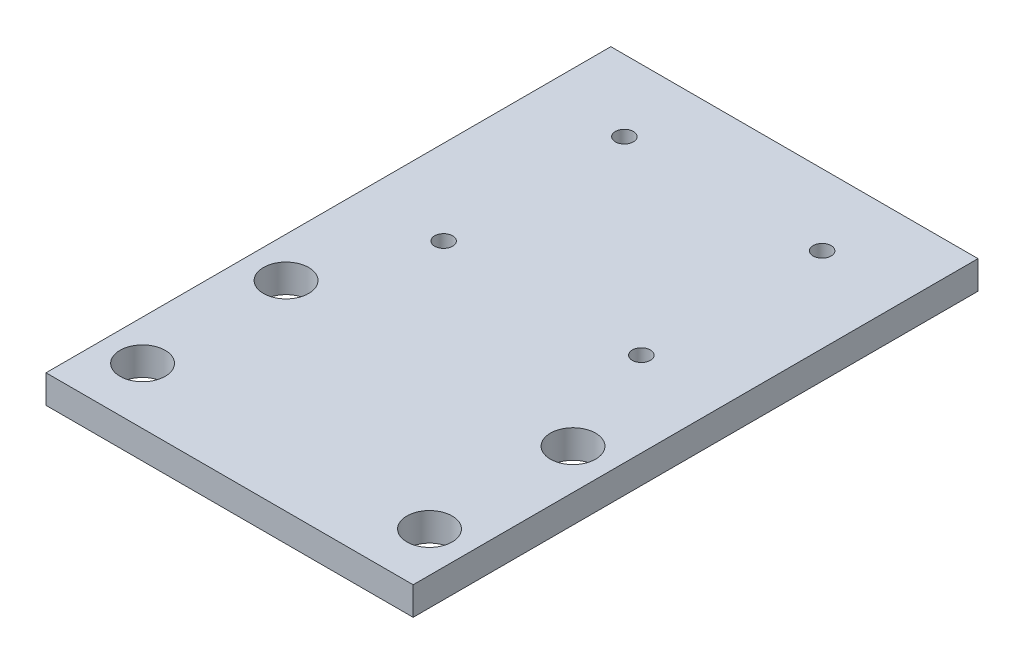
ISO-10303-21;
HEADER;
FILE_DESCRIPTION(('STEP AP214'),'2;1');
FILE_NAME('part.step','',(''),(''),'','','');
FILE_SCHEMA(('AUTOMOTIVE_DESIGN { 1 0 10303 214 1 1 1 1 }'));
ENDSEC;
DATA;
#1=APPLICATION_CONTEXT('core data for automotive mechanical design processes');
#2=APPLICATION_PROTOCOL_DEFINITION('international standard','automotive_design',2000,#1);
#3=PRODUCT_CONTEXT('',#1,'mechanical');
#4=PRODUCT('Part','Part','',(#3));
#5=PRODUCT_RELATED_PRODUCT_CATEGORY('part','',(#4));
#6=PRODUCT_DEFINITION_FORMATION('','',#4);
#7=PRODUCT_DEFINITION_CONTEXT('part definition',#1,'design');
#8=PRODUCT_DEFINITION('design','',#6,#7);
#9=PRODUCT_DEFINITION_SHAPE('','',#8);
#10=(LENGTH_UNIT() NAMED_UNIT(*) SI_UNIT(.MILLI.,.METRE.));
#11=(NAMED_UNIT(*) PLANE_ANGLE_UNIT() SI_UNIT($,.RADIAN.));
#12=(NAMED_UNIT(*) SI_UNIT($,.STERADIAN.) SOLID_ANGLE_UNIT());
#13=UNCERTAINTY_MEASURE_WITH_UNIT(LENGTH_MEASURE(1.E-05),#10,'distance_accuracy_value','');
#14=(GEOMETRIC_REPRESENTATION_CONTEXT(3) GLOBAL_UNCERTAINTY_ASSIGNED_CONTEXT((#13)) GLOBAL_UNIT_ASSIGNED_CONTEXT((#10,
#11,#12)) REPRESENTATION_CONTEXT('',''));
#15=CARTESIAN_POINT('',(0.,0.,0.));
#16=DIRECTION('',(0.,0.,1.));
#17=DIRECTION('',(1.,0.,0.));
#18=AXIS2_PLACEMENT_3D('',#15,#16,#17);
#19=CARTESIAN_POINT('',(17.5,5.,-37.4));
#20=DIRECTION('',(0.,-1.,0.));
#21=DIRECTION('',(0.,0.,-1.));
#22=AXIS2_PLACEMENT_3D('',#19,#20,#21);
#23=CYLINDRICAL_SURFACE('',#22,1.6);
#24=CARTESIAN_POINT('',(17.5,5.,-37.4));
#25=DIRECTION('',(0.,1.,0.));
#26=DIRECTION('',(0.,0.,-1.));
#27=AXIS2_PLACEMENT_3D('',#24,#25,#26);
#28=CIRCLE('',#27,1.6);
#29=CARTESIAN_POINT('',(17.5,5.,-39.));
#30=VERTEX_POINT('',#29);
#31=EDGE_CURVE('E148',#30,#30,#28,.T.);
#32=ORIENTED_EDGE('',*,*,#31,.T.);
#33=EDGE_LOOP('',(#32));
#34=FACE_BOUND('',#33,.T.);
#35=CARTESIAN_POINT('',(17.5,2.,-37.4));
#36=DIRECTION('',(0.,-1.,0.));
#37=DIRECTION('',(0.,0.,-1.));
#38=AXIS2_PLACEMENT_3D('',#35,#36,#37);
#39=CIRCLE('',#38,1.6);
#40=CARTESIAN_POINT('',(17.5,2.,-39.));
#41=VERTEX_POINT('',#40);
#42=EDGE_CURVE('E39',#41,#41,#39,.T.);
#43=ORIENTED_EDGE('',*,*,#42,.T.);
#44=EDGE_LOOP('',(#43));
#45=FACE_BOUND('',#44,.T.);
#46=ADVANCED_FACE('F35',(#34,#45),#23,.F.);
#47=CARTESIAN_POINT('',(-17.5,5.,-37.4));
#48=DIRECTION('',(0.,-1.,0.));
#49=DIRECTION('',(0.,0.,-1.));
#50=AXIS2_PLACEMENT_3D('',#47,#48,#49);
#51=CYLINDRICAL_SURFACE('',#50,1.6);
#52=CARTESIAN_POINT('',(-17.5,5.,-37.4));
#53=DIRECTION('',(0.,1.,0.));
#54=DIRECTION('',(0.,0.,1.));
#55=AXIS2_PLACEMENT_3D('',#52,#53,#54);
#56=CIRCLE('',#55,1.6);
#57=CARTESIAN_POINT('',(-17.5,5.,-35.8));
#58=VERTEX_POINT('',#57);
#59=EDGE_CURVE('E151',#58,#58,#56,.T.);
#60=ORIENTED_EDGE('',*,*,#59,.T.);
#61=EDGE_LOOP('',(#60));
#62=FACE_BOUND('',#61,.T.);
#63=CARTESIAN_POINT('',(-17.5,2.,-37.4));
#64=DIRECTION('',(0.,-1.,0.));
#65=DIRECTION('',(0.,0.,-1.));
#66=AXIS2_PLACEMENT_3D('',#63,#64,#65);
#67=CIRCLE('',#66,1.6);
#68=CARTESIAN_POINT('',(-17.5,2.,-39.));
#69=VERTEX_POINT('',#68);
#70=EDGE_CURVE('E121',#69,#69,#67,.T.);
#71=ORIENTED_EDGE('',*,*,#70,.T.);
#72=EDGE_LOOP('',(#71));
#73=FACE_BOUND('',#72,.T.);
#74=ADVANCED_FACE('F200',(#62,#73),#51,.F.);
#75=CARTESIAN_POINT('',(17.5,5.,-5.39999999999998));
#76=DIRECTION('',(0.,-1.,0.));
#77=DIRECTION('',(0.,0.,-1.));
#78=AXIS2_PLACEMENT_3D('',#75,#76,#77);
#79=CYLINDRICAL_SURFACE('',#78,1.60000000000001);
#80=CARTESIAN_POINT('',(17.5,5.,-5.39999999999998));
#81=DIRECTION('',(0.,1.,0.));
#82=DIRECTION('',(0.,0.,-1.));
#83=AXIS2_PLACEMENT_3D('',#80,#81,#82);
#84=CIRCLE('',#83,1.60000000000001);
#85=CARTESIAN_POINT('',(17.5,5.,-6.99999999999998));
#86=VERTEX_POINT('',#85);
#87=EDGE_CURVE('E115',#86,#86,#84,.T.);
#88=ORIENTED_EDGE('',*,*,#87,.T.);
#89=EDGE_LOOP('',(#88));
#90=FACE_BOUND('',#89,.T.);
#91=CARTESIAN_POINT('',(17.5,2.,-5.39999999999998));
#92=DIRECTION('',(0.,-1.,0.));
#93=DIRECTION('',(0.,0.,-1.));
#94=AXIS2_PLACEMENT_3D('',#91,#92,#93);
#95=CIRCLE('',#94,1.60000000000001);
#96=CARTESIAN_POINT('',(17.5,2.,-6.99999999999998));
#97=VERTEX_POINT('',#96);
#98=EDGE_CURVE('E117',#97,#97,#95,.T.);
#99=ORIENTED_EDGE('',*,*,#98,.T.);
#100=EDGE_LOOP('',(#99));
#101=FACE_BOUND('',#100,.T.);
#102=ADVANCED_FACE('F206',(#90,#101),#79,.F.);
#103=CARTESIAN_POINT('',(-17.5,5.,-5.39999999999998));
#104=DIRECTION('',(0.,-1.,0.));
#105=DIRECTION('',(0.,0.,-1.));
#106=AXIS2_PLACEMENT_3D('',#103,#104,#105);
#107=CYLINDRICAL_SURFACE('',#106,1.6);
#108=CARTESIAN_POINT('',(-17.5,5.,-5.39999999999998));
#109=DIRECTION('',(0.,1.,0.));
#110=DIRECTION('',(0.,0.,1.));
#111=AXIS2_PLACEMENT_3D('',#108,#109,#110);
#112=CIRCLE('',#111,1.6);
#113=CARTESIAN_POINT('',(-17.5,5.,-3.79999999999998));
#114=VERTEX_POINT('',#113);
#115=EDGE_CURVE('E154',#114,#114,#112,.T.);
#116=ORIENTED_EDGE('',*,*,#115,.T.);
#117=EDGE_LOOP('',(#116));
#118=FACE_BOUND('',#117,.T.);
#119=CARTESIAN_POINT('',(-17.5,2.,-5.39999999999998));
#120=DIRECTION('',(0.,-1.,0.));
#121=DIRECTION('',(0.,0.,-1.));
#122=AXIS2_PLACEMENT_3D('',#119,#120,#121);
#123=CIRCLE('',#122,1.6);
#124=CARTESIAN_POINT('',(-17.5,2.,-6.99999999999998));
#125=VERTEX_POINT('',#124);
#126=EDGE_CURVE('E112',#125,#125,#123,.T.);
#127=ORIENTED_EDGE('',*,*,#126,.T.);
#128=EDGE_LOOP('',(#127));
#129=FACE_BOUND('',#128,.T.);
#130=ADVANCED_FACE('F213',(#118,#129),#107,.F.);
#131=CARTESIAN_POINT('',(0.,5.,0.));
#132=DIRECTION('',(0.,1.,0.));
#133=DIRECTION('',(0.,0.,1.));
#134=AXIS2_PLACEMENT_3D('',#131,#132,#133);
#135=PLANE('',#134);
#136=ORIENTED_EDGE('',*,*,#31,.F.);
#137=EDGE_LOOP('',(#136));
#138=FACE_BOUND('',#137,.T.);
#139=ORIENTED_EDGE('',*,*,#115,.F.);
#140=EDGE_LOOP('',(#139));
#141=FACE_BOUND('',#140,.T.);
#142=CARTESIAN_POINT('',(-25.4000000000001,5.,14.6));
#143=DIRECTION('',(0.,1.,0.));
#144=DIRECTION('',(0.,0.,1.));
#145=AXIS2_PLACEMENT_3D('',#142,#143,#144);
#146=CIRCLE('',#145,4.);
#147=CARTESIAN_POINT('',(-25.4000000000001,5.,18.6));
#148=VERTEX_POINT('',#147);
#149=EDGE_CURVE('E164',#148,#148,#146,.T.);
#150=ORIENTED_EDGE('',*,*,#149,.F.);
#151=EDGE_LOOP('',(#150));
#152=FACE_BOUND('',#151,.T.);
#153=CARTESIAN_POINT('',(-25.4,5.,40.));
#154=DIRECTION('',(0.,1.,0.));
#155=DIRECTION('',(0.,0.,1.));
#156=AXIS2_PLACEMENT_3D('',#153,#154,#155);
#157=CIRCLE('',#156,4.);
#158=CARTESIAN_POINT('',(-25.4,5.,44.));
#159=VERTEX_POINT('',#158);
#160=EDGE_CURVE('E106',#159,#159,#157,.T.);
#161=ORIENTED_EDGE('',*,*,#160,.F.);
#162=EDGE_LOOP('',(#161));
#163=FACE_BOUND('',#162,.T.);
#164=DIRECTION('',(0.,0.,-1.));
#165=VECTOR('',#164,1.);
#166=CARTESIAN_POINT('',(32.5,5.,-50.));
#167=LINE('',#166,#165);
#168=CARTESIAN_POINT('',(32.5,5.,50.));
#169=VERTEX_POINT('',#168);
#170=CARTESIAN_POINT('',(32.5,5.,-50.));
#171=VERTEX_POINT('',#170);
#172=EDGE_CURVE('E90',#169,#171,#167,.T.);
#173=ORIENTED_EDGE('',*,*,#172,.T.);
#174=DIRECTION('',(-1.,0.,0.));
#175=VECTOR('',#174,1.);
#176=CARTESIAN_POINT('',(-32.5,5.,-50.));
#177=LINE('',#176,#175);
#178=CARTESIAN_POINT('',(-32.5,5.,-50.));
#179=VERTEX_POINT('',#178);
#180=EDGE_CURVE('E84',#171,#179,#177,.T.);
#181=ORIENTED_EDGE('',*,*,#180,.T.);
#182=DIRECTION('',(0.,0.,1.));
#183=VECTOR('',#182,1.);
#184=CARTESIAN_POINT('',(-32.5,5.,-50.));
#185=LINE('',#184,#183);
#186=CARTESIAN_POINT('',(-32.5,5.,50.));
#187=VERTEX_POINT('',#186);
#188=EDGE_CURVE('E88',#179,#187,#185,.T.);
#189=ORIENTED_EDGE('',*,*,#188,.T.);
#190=DIRECTION('',(1.,0.,0.));
#191=VECTOR('',#190,1.);
#192=CARTESIAN_POINT('',(-32.5,5.,50.));
#193=LINE('',#192,#191);
#194=EDGE_CURVE('E54',#187,#169,#193,.T.);
#195=ORIENTED_EDGE('',*,*,#194,.T.);
#196=EDGE_LOOP('',(#173,#181,#189,#195));
#197=FACE_BOUND('',#196,.T.);
#198=CARTESIAN_POINT('',(25.4,5.,40.));
#199=DIRECTION('',(0.,1.,0.));
#200=DIRECTION('',(0.,0.,1.));
#201=AXIS2_PLACEMENT_3D('',#198,#199,#200);
#202=CIRCLE('',#201,4.);
#203=CARTESIAN_POINT('',(25.4,5.,44.));
#204=VERTEX_POINT('',#203);
#205=EDGE_CURVE('E170',#204,#204,#202,.T.);
#206=ORIENTED_EDGE('',*,*,#205,.F.);
#207=EDGE_LOOP('',(#206));
#208=FACE_BOUND('',#207,.T.);
#209=CARTESIAN_POINT('',(25.3999999999999,5.,14.6));
#210=DIRECTION('',(0.,1.,0.));
#211=DIRECTION('',(0.,0.,1.));
#212=AXIS2_PLACEMENT_3D('',#209,#210,#211);
#213=CIRCLE('',#212,4.);
#214=CARTESIAN_POINT('',(25.3999999999999,5.,18.6));
#215=VERTEX_POINT('',#214);
#216=EDGE_CURVE('E158',#215,#215,#213,.T.);
#217=ORIENTED_EDGE('',*,*,#216,.F.);
#218=EDGE_LOOP('',(#217));
#219=FACE_BOUND('',#218,.T.);
#220=ORIENTED_EDGE('',*,*,#59,.F.);
#221=EDGE_LOOP('',(#220));
#222=FACE_BOUND('',#221,.T.);
#223=ORIENTED_EDGE('',*,*,#87,.F.);
#224=EDGE_LOOP('',(#223));
#225=FACE_BOUND('',#224,.T.);
#226=ADVANCED_FACE('F85',(#138,#141,#152,#163,#197,#208,#219,#222,#225),#135,.T.);
#227=CARTESIAN_POINT('',(0.,0.,0.));
#228=DIRECTION('',(0.,1.,0.));
#229=DIRECTION('',(0.,0.,1.));
#230=AXIS2_PLACEMENT_3D('',#227,#228,#229);
#231=PLANE('',#230);
#232=CARTESIAN_POINT('',(17.5,0.,-37.4));
#233=DIRECTION('',(0.,-1.,0.));
#234=DIRECTION('',(0.,0.,-1.));
#235=AXIS2_PLACEMENT_3D('',#232,#233,#234);
#236=CIRCLE('',#235,3.5);
#237=CARTESIAN_POINT('',(17.5,0.,-40.9));
#238=VERTEX_POINT('',#237);
#239=EDGE_CURVE('E137',#238,#238,#236,.T.);
#240=ORIENTED_EDGE('',*,*,#239,.F.);
#241=EDGE_LOOP('',(#240));
#242=FACE_BOUND('',#241,.T.);
#243=CARTESIAN_POINT('',(-17.5,0.,-37.4));
#244=DIRECTION('',(0.,-1.,0.));
#245=DIRECTION('',(0.,0.,-1.));
#246=AXIS2_PLACEMENT_3D('',#243,#244,#245);
#247=CIRCLE('',#246,3.5);
#248=CARTESIAN_POINT('',(-17.5,0.,-40.9));
#249=VERTEX_POINT('',#248);
#250=EDGE_CURVE('E130',#249,#249,#247,.T.);
#251=ORIENTED_EDGE('',*,*,#250,.F.);
#252=EDGE_LOOP('',(#251));
#253=FACE_BOUND('',#252,.T.);
#254=CARTESIAN_POINT('',(17.5,0.,-5.39999999999998));
#255=DIRECTION('',(0.,-1.,0.));
#256=DIRECTION('',(0.,0.,-1.));
#257=AXIS2_PLACEMENT_3D('',#254,#255,#256);
#258=CIRCLE('',#257,3.5);
#259=CARTESIAN_POINT('',(17.5,0.,-8.89999999999998));
#260=VERTEX_POINT('',#259);
#261=EDGE_CURVE('E123',#260,#260,#258,.T.);
#262=ORIENTED_EDGE('',*,*,#261,.F.);
#263=EDGE_LOOP('',(#262));
#264=FACE_BOUND('',#263,.T.);
#265=CARTESIAN_POINT('',(-17.5,0.,-5.39999999999998));
#266=DIRECTION('',(0.,-1.,0.));
#267=DIRECTION('',(0.,0.,-1.));
#268=AXIS2_PLACEMENT_3D('',#265,#266,#267);
#269=CIRCLE('',#268,3.5);
#270=CARTESIAN_POINT('',(-17.5,0.,-8.89999999999998));
#271=VERTEX_POINT('',#270);
#272=EDGE_CURVE('E119',#271,#271,#269,.T.);
#273=ORIENTED_EDGE('',*,*,#272,.F.);
#274=EDGE_LOOP('',(#273));
#275=FACE_BOUND('',#274,.T.);
#276=DIRECTION('',(0.,0.,-1.));
#277=VECTOR('',#276,1.);
#278=CARTESIAN_POINT('',(32.5,0.,-50.));
#279=LINE('',#278,#277);
#280=CARTESIAN_POINT('',(32.5,0.,50.));
#281=VERTEX_POINT('',#280);
#282=CARTESIAN_POINT('',(32.5,0.,-50.));
#283=VERTEX_POINT('',#282);
#284=EDGE_CURVE('E103',#281,#283,#279,.T.);
#285=ORIENTED_EDGE('',*,*,#284,.F.);
#286=DIRECTION('',(1.,0.,0.));
#287=VECTOR('',#286,1.);
#288=CARTESIAN_POINT('',(-32.5,0.,50.));
#289=LINE('',#288,#287);
#290=CARTESIAN_POINT('',(-32.5,0.,50.));
#291=VERTEX_POINT('',#290);
#292=EDGE_CURVE('E77',#291,#281,#289,.T.);
#293=ORIENTED_EDGE('',*,*,#292,.F.);
#294=DIRECTION('',(0.,0.,1.));
#295=VECTOR('',#294,1.);
#296=CARTESIAN_POINT('',(-32.5,0.,-50.));
#297=LINE('',#296,#295);
#298=CARTESIAN_POINT('',(-32.5,0.,-50.));
#299=VERTEX_POINT('',#298);
#300=EDGE_CURVE('E71',#299,#291,#297,.T.);
#301=ORIENTED_EDGE('',*,*,#300,.F.);
#302=DIRECTION('',(-1.,0.,0.));
#303=VECTOR('',#302,1.);
#304=CARTESIAN_POINT('',(-32.5,0.,-50.));
#305=LINE('',#304,#303);
#306=EDGE_CURVE('E94',#283,#299,#305,.T.);
#307=ORIENTED_EDGE('',*,*,#306,.F.);
#308=EDGE_LOOP('',(#285,#293,#301,#307));
#309=FACE_BOUND('',#308,.T.);
#310=CARTESIAN_POINT('',(-25.4,0.,40.));
#311=DIRECTION('',(0.,1.,0.));
#312=DIRECTION('',(0.,0.,1.));
#313=AXIS2_PLACEMENT_3D('',#310,#311,#312);
#314=CIRCLE('',#313,4.);
#315=CARTESIAN_POINT('',(-25.4,0.,44.));
#316=VERTEX_POINT('',#315);
#317=EDGE_CURVE('E173',#316,#316,#314,.T.);
#318=ORIENTED_EDGE('',*,*,#317,.T.);
#319=EDGE_LOOP('',(#318));
#320=FACE_BOUND('',#319,.T.);
#321=CARTESIAN_POINT('',(25.4,0.,40.));
#322=DIRECTION('',(0.,1.,0.));
#323=DIRECTION('',(0.,0.,1.));
#324=AXIS2_PLACEMENT_3D('',#321,#322,#323);
#325=CIRCLE('',#324,4.);
#326=CARTESIAN_POINT('',(25.4,0.,44.));
#327=VERTEX_POINT('',#326);
#328=EDGE_CURVE('E167',#327,#327,#325,.T.);
#329=ORIENTED_EDGE('',*,*,#328,.T.);
#330=EDGE_LOOP('',(#329));
#331=FACE_BOUND('',#330,.T.);
#332=CARTESIAN_POINT('',(-25.4000000000001,0.,14.6));
#333=DIRECTION('',(0.,1.,0.));
#334=DIRECTION('',(0.,0.,1.));
#335=AXIS2_PLACEMENT_3D('',#332,#333,#334);
#336=CIRCLE('',#335,4.);
#337=CARTESIAN_POINT('',(-25.4000000000001,0.,18.6));
#338=VERTEX_POINT('',#337);
#339=EDGE_CURVE('E161',#338,#338,#336,.T.);
#340=ORIENTED_EDGE('',*,*,#339,.T.);
#341=EDGE_LOOP('',(#340));
#342=FACE_BOUND('',#341,.T.);
#343=CARTESIAN_POINT('',(25.3999999999999,0.,14.6));
#344=DIRECTION('',(0.,1.,0.));
#345=DIRECTION('',(0.,0.,1.));
#346=AXIS2_PLACEMENT_3D('',#343,#344,#345);
#347=CIRCLE('',#346,4.);
#348=CARTESIAN_POINT('',(25.3999999999999,0.,18.6));
#349=VERTEX_POINT('',#348);
#350=EDGE_CURVE('E157',#349,#349,#347,.T.);
#351=ORIENTED_EDGE('',*,*,#350,.T.);
#352=EDGE_LOOP('',(#351));
#353=FACE_BOUND('',#352,.T.);
#354=ADVANCED_FACE('F181',(#242,#253,#264,#275,#309,#320,#331,#342,#353),#231,.F.);
#355=CARTESIAN_POINT('',(32.5,5.,-50.));
#356=DIRECTION('',(-1.,0.,0.));
#357=DIRECTION('',(0.,0.,1.));
#358=AXIS2_PLACEMENT_3D('',#355,#356,#357);
#359=PLANE('',#358);
#360=ORIENTED_EDGE('',*,*,#284,.T.);
#361=DIRECTION('',(0.,-1.,0.));
#362=VECTOR('',#361,1.);
#363=CARTESIAN_POINT('',(32.5,5.,-50.));
#364=LINE('',#363,#362);
#365=EDGE_CURVE('E11',#171,#283,#364,.T.);
#366=ORIENTED_EDGE('',*,*,#365,.F.);
#367=ORIENTED_EDGE('',*,*,#172,.F.);
#368=DIRECTION('',(0.,-1.,0.));
#369=VECTOR('',#368,1.);
#370=CARTESIAN_POINT('',(32.5,5.,50.));
#371=LINE('',#370,#369);
#372=EDGE_CURVE('E99',#169,#281,#371,.T.);
#373=ORIENTED_EDGE('',*,*,#372,.T.);
#374=EDGE_LOOP('',(#360,#366,#367,#373));
#375=FACE_BOUND('',#374,.T.);
#376=ADVANCED_FACE('F37',(#375),#359,.F.);
#377=CARTESIAN_POINT('',(-32.5,5.,-50.));
#378=DIRECTION('',(0.,0.,1.));
#379=DIRECTION('',(1.,0.,0.));
#380=AXIS2_PLACEMENT_3D('',#377,#378,#379);
#381=PLANE('',#380);
#382=ORIENTED_EDGE('',*,*,#306,.T.);
#383=DIRECTION('',(0.,-1.,0.));
#384=VECTOR('',#383,1.);
#385=CARTESIAN_POINT('',(-32.5,5.,-50.));
#386=LINE('',#385,#384);
#387=EDGE_CURVE('E45',#179,#299,#386,.T.);
#388=ORIENTED_EDGE('',*,*,#387,.F.);
#389=ORIENTED_EDGE('',*,*,#180,.F.);
#390=ORIENTED_EDGE('',*,*,#365,.T.);
#391=EDGE_LOOP('',(#382,#388,#389,#390));
#392=FACE_BOUND('',#391,.T.);
#393=ADVANCED_FACE('F93',(#392),#381,.F.);
#394=CARTESIAN_POINT('',(-32.5,5.,-50.));
#395=DIRECTION('',(1.,0.,0.));
#396=DIRECTION('',(0.,0.,-1.));
#397=AXIS2_PLACEMENT_3D('',#394,#395,#396);
#398=PLANE('',#397);
#399=ORIENTED_EDGE('',*,*,#300,.T.);
#400=DIRECTION('',(0.,-1.,0.));
#401=VECTOR('',#400,1.);
#402=CARTESIAN_POINT('',(-32.5,5.,50.));
#403=LINE('',#402,#401);
#404=EDGE_CURVE('E95',#187,#291,#403,.T.);
#405=ORIENTED_EDGE('',*,*,#404,.F.);
#406=ORIENTED_EDGE('',*,*,#188,.F.);
#407=ORIENTED_EDGE('',*,*,#387,.T.);
#408=EDGE_LOOP('',(#399,#405,#406,#407));
#409=FACE_BOUND('',#408,.T.);
#410=ADVANCED_FACE('F97',(#409),#398,.F.);
#411=CARTESIAN_POINT('',(-32.5,5.,50.));
#412=DIRECTION('',(0.,0.,-1.));
#413=DIRECTION('',(-1.,0.,0.));
#414=AXIS2_PLACEMENT_3D('',#411,#412,#413);
#415=PLANE('',#414);
#416=ORIENTED_EDGE('',*,*,#292,.T.);
#417=ORIENTED_EDGE('',*,*,#372,.F.);
#418=ORIENTED_EDGE('',*,*,#194,.F.);
#419=ORIENTED_EDGE('',*,*,#404,.T.);
#420=EDGE_LOOP('',(#416,#417,#418,#419));
#421=FACE_BOUND('',#420,.T.);
#422=ADVANCED_FACE('F187',(#421),#415,.F.);
#423=CARTESIAN_POINT('',(-25.4,5.,40.));
#424=DIRECTION('',(0.,-1.,0.));
#425=DIRECTION('',(0.,0.,-1.));
#426=AXIS2_PLACEMENT_3D('',#423,#424,#425);
#427=CYLINDRICAL_SURFACE('',#426,4.);
#428=ORIENTED_EDGE('',*,*,#160,.T.);
#429=EDGE_LOOP('',(#428));
#430=FACE_BOUND('',#429,.T.);
#431=ORIENTED_EDGE('',*,*,#317,.F.);
#432=EDGE_LOOP('',(#431));
#433=FACE_BOUND('',#432,.T.);
#434=ADVANCED_FACE('F184',(#430,#433),#427,.F.);
#435=CARTESIAN_POINT('',(25.4,5.,40.));
#436=DIRECTION('',(0.,-1.,0.));
#437=DIRECTION('',(0.,0.,-1.));
#438=AXIS2_PLACEMENT_3D('',#435,#436,#437);
#439=CYLINDRICAL_SURFACE('',#438,4.);
#440=ORIENTED_EDGE('',*,*,#205,.T.);
#441=EDGE_LOOP('',(#440));
#442=FACE_BOUND('',#441,.T.);
#443=ORIENTED_EDGE('',*,*,#328,.F.);
#444=EDGE_LOOP('',(#443));
#445=FACE_BOUND('',#444,.T.);
#446=ADVANCED_FACE('F186',(#442,#445),#439,.F.);
#447=CARTESIAN_POINT('',(-25.4000000000001,5.,14.6));
#448=DIRECTION('',(0.,-1.,0.));
#449=DIRECTION('',(0.,0.,-1.));
#450=AXIS2_PLACEMENT_3D('',#447,#448,#449);
#451=CYLINDRICAL_SURFACE('',#450,4.);
#452=ORIENTED_EDGE('',*,*,#149,.T.);
#453=EDGE_LOOP('',(#452));
#454=FACE_BOUND('',#453,.T.);
#455=ORIENTED_EDGE('',*,*,#339,.F.);
#456=EDGE_LOOP('',(#455));
#457=FACE_BOUND('',#456,.T.);
#458=ADVANCED_FACE('F194',(#454,#457),#451,.F.);
#459=CARTESIAN_POINT('',(25.3999999999999,5.,14.6));
#460=DIRECTION('',(0.,-1.,0.));
#461=DIRECTION('',(0.,0.,-1.));
#462=AXIS2_PLACEMENT_3D('',#459,#460,#461);
#463=CYLINDRICAL_SURFACE('',#462,4.);
#464=ORIENTED_EDGE('',*,*,#216,.T.);
#465=EDGE_LOOP('',(#464));
#466=FACE_BOUND('',#465,.T.);
#467=ORIENTED_EDGE('',*,*,#350,.F.);
#468=EDGE_LOOP('',(#467));
#469=FACE_BOUND('',#468,.T.);
#470=ADVANCED_FACE('F217',(#466,#469),#463,.F.);
#471=CARTESIAN_POINT('',(-17.5,2.,-5.39999999999998));
#472=DIRECTION('',(0.,-1.,0.));
#473=DIRECTION('',(0.,0.,-1.));
#474=AXIS2_PLACEMENT_3D('',#471,#472,#473);
#475=CYLINDRICAL_SURFACE('',#474,3.5);
#476=CARTESIAN_POINT('',(-17.5,2.,-5.39999999999998));
#477=DIRECTION('',(0.,-1.,0.));
#478=DIRECTION('',(0.,0.,-1.));
#479=AXIS2_PLACEMENT_3D('',#476,#477,#478);
#480=CIRCLE('',#479,3.5);
#481=CARTESIAN_POINT('',(-17.5,2.,-8.89999999999998));
#482=VERTEX_POINT('',#481);
#483=EDGE_CURVE('E116',#482,#482,#480,.T.);
#484=ORIENTED_EDGE('',*,*,#483,.F.);
#485=EDGE_LOOP('',(#484));
#486=FACE_BOUND('',#485,.T.);
#487=ORIENTED_EDGE('',*,*,#272,.T.);
#488=EDGE_LOOP('',(#487));
#489=FACE_BOUND('',#488,.T.);
#490=ADVANCED_FACE('F220',(#486,#489),#475,.F.);
#491=CARTESIAN_POINT('',(-17.5,2.,-5.39999999999998));
#492=DIRECTION('',(0.,-1.,0.));
#493=DIRECTION('',(0.,0.,-1.));
#494=AXIS2_PLACEMENT_3D('',#491,#492,#493);
#495=PLANE('',#494);
#496=ORIENTED_EDGE('',*,*,#126,.F.);
#497=EDGE_LOOP('',(#496));
#498=FACE_BOUND('',#497,.T.);
#499=ORIENTED_EDGE('',*,*,#483,.T.);
#500=EDGE_LOOP('',(#499));
#501=FACE_BOUND('',#500,.T.);
#502=ADVANCED_FACE('F318',(#498,#501),#495,.T.);
#503=CARTESIAN_POINT('',(17.5,2.,-5.39999999999998));
#504=DIRECTION('',(0.,-1.,0.));
#505=DIRECTION('',(0.,0.,-1.));
#506=AXIS2_PLACEMENT_3D('',#503,#504,#505);
#507=CYLINDRICAL_SURFACE('',#506,3.5);
#508=CARTESIAN_POINT('',(17.5,2.,-5.39999999999998));
#509=DIRECTION('',(0.,-1.,0.));
#510=DIRECTION('',(0.,0.,-1.));
#511=AXIS2_PLACEMENT_3D('',#508,#509,#510);
#512=CIRCLE('',#511,3.5);
#513=CARTESIAN_POINT('',(17.5,2.,-8.89999999999998));
#514=VERTEX_POINT('',#513);
#515=EDGE_CURVE('E120',#514,#514,#512,.T.);
#516=ORIENTED_EDGE('',*,*,#515,.F.);
#517=EDGE_LOOP('',(#516));
#518=FACE_BOUND('',#517,.T.);
#519=ORIENTED_EDGE('',*,*,#261,.T.);
#520=EDGE_LOOP('',(#519));
#521=FACE_BOUND('',#520,.T.);
#522=ADVANCED_FACE('F327',(#518,#521),#507,.F.);
#523=CARTESIAN_POINT('',(17.5,2.,-5.39999999999998));
#524=DIRECTION('',(0.,-1.,0.));
#525=DIRECTION('',(0.,0.,-1.));
#526=AXIS2_PLACEMENT_3D('',#523,#524,#525);
#527=PLANE('',#526);
#528=ORIENTED_EDGE('',*,*,#98,.F.);
#529=EDGE_LOOP('',(#528));
#530=FACE_BOUND('',#529,.T.);
#531=ORIENTED_EDGE('',*,*,#515,.T.);
#532=EDGE_LOOP('',(#531));
#533=FACE_BOUND('',#532,.T.);
#534=ADVANCED_FACE('F337',(#530,#533),#527,.T.);
#535=CARTESIAN_POINT('',(-17.5,2.,-37.4));
#536=DIRECTION('',(0.,-1.,0.));
#537=DIRECTION('',(0.,0.,-1.));
#538=AXIS2_PLACEMENT_3D('',#535,#536,#537);
#539=CYLINDRICAL_SURFACE('',#538,3.5);
#540=CARTESIAN_POINT('',(-17.5,2.,-37.4));
#541=DIRECTION('',(0.,-1.,0.));
#542=DIRECTION('',(0.,0.,-1.));
#543=AXIS2_PLACEMENT_3D('',#540,#541,#542);
#544=CIRCLE('',#543,3.5);
#545=CARTESIAN_POINT('',(-17.5,2.,-40.9));
#546=VERTEX_POINT('',#545);
#547=EDGE_CURVE('E124',#546,#546,#544,.T.);
#548=ORIENTED_EDGE('',*,*,#547,.F.);
#549=EDGE_LOOP('',(#548));
#550=FACE_BOUND('',#549,.T.);
#551=ORIENTED_EDGE('',*,*,#250,.T.);
#552=EDGE_LOOP('',(#551));
#553=FACE_BOUND('',#552,.T.);
#554=ADVANCED_FACE('F347',(#550,#553),#539,.F.);
#555=CARTESIAN_POINT('',(-17.5,2.,-37.4));
#556=DIRECTION('',(0.,-1.,0.));
#557=DIRECTION('',(0.,0.,-1.));
#558=AXIS2_PLACEMENT_3D('',#555,#556,#557);
#559=PLANE('',#558);
#560=ORIENTED_EDGE('',*,*,#70,.F.);
#561=EDGE_LOOP('',(#560));
#562=FACE_BOUND('',#561,.T.);
#563=ORIENTED_EDGE('',*,*,#547,.T.);
#564=EDGE_LOOP('',(#563));
#565=FACE_BOUND('',#564,.T.);
#566=ADVANCED_FACE('F357',(#562,#565),#559,.T.);
#567=CARTESIAN_POINT('',(17.5,2.,-37.4));
#568=DIRECTION('',(0.,-1.,0.));
#569=DIRECTION('',(0.,0.,-1.));
#570=AXIS2_PLACEMENT_3D('',#567,#568,#569);
#571=CYLINDRICAL_SURFACE('',#570,3.5);
#572=CARTESIAN_POINT('',(17.5,2.,-37.4));
#573=DIRECTION('',(0.,-1.,0.));
#574=DIRECTION('',(0.,0.,-1.));
#575=AXIS2_PLACEMENT_3D('',#572,#573,#574);
#576=CIRCLE('',#575,3.5);
#577=CARTESIAN_POINT('',(17.5,2.,-40.9));
#578=VERTEX_POINT('',#577);
#579=EDGE_CURVE('E396',#578,#578,#576,.T.);
#580=ORIENTED_EDGE('',*,*,#579,.F.);
#581=EDGE_LOOP('',(#580));
#582=FACE_BOUND('',#581,.T.);
#583=ORIENTED_EDGE('',*,*,#239,.T.);
#584=EDGE_LOOP('',(#583));
#585=FACE_BOUND('',#584,.T.);
#586=ADVANCED_FACE('F367',(#582,#585),#571,.F.);
#587=CARTESIAN_POINT('',(17.5,2.,-37.4));
#588=DIRECTION('',(0.,-1.,0.));
#589=DIRECTION('',(0.,0.,-1.));
#590=AXIS2_PLACEMENT_3D('',#587,#588,#589);
#591=PLANE('',#590);
#592=ORIENTED_EDGE('',*,*,#42,.F.);
#593=EDGE_LOOP('',(#592));
#594=FACE_BOUND('',#593,.T.);
#595=ORIENTED_EDGE('',*,*,#579,.T.);
#596=EDGE_LOOP('',(#595));
#597=FACE_BOUND('',#596,.T.);
#598=ADVANCED_FACE('F377',(#594,#597),#591,.T.);
#599=CLOSED_SHELL('',(#46,#74,#102,#130,#226,#354,#376,#393,#410,#422,#434,#446,#458,#470,#490,
#502,#522,#534,#554,#566,#586,#598));
#600=MANIFOLD_SOLID_BREP('B2',#599);
#601=ADVANCED_BREP_SHAPE_REPRESENTATION('',(#18,#600),#14);
#602=SHAPE_DEFINITION_REPRESENTATION(#9,#601);
ENDSEC;
END-ISO-10303-21;
